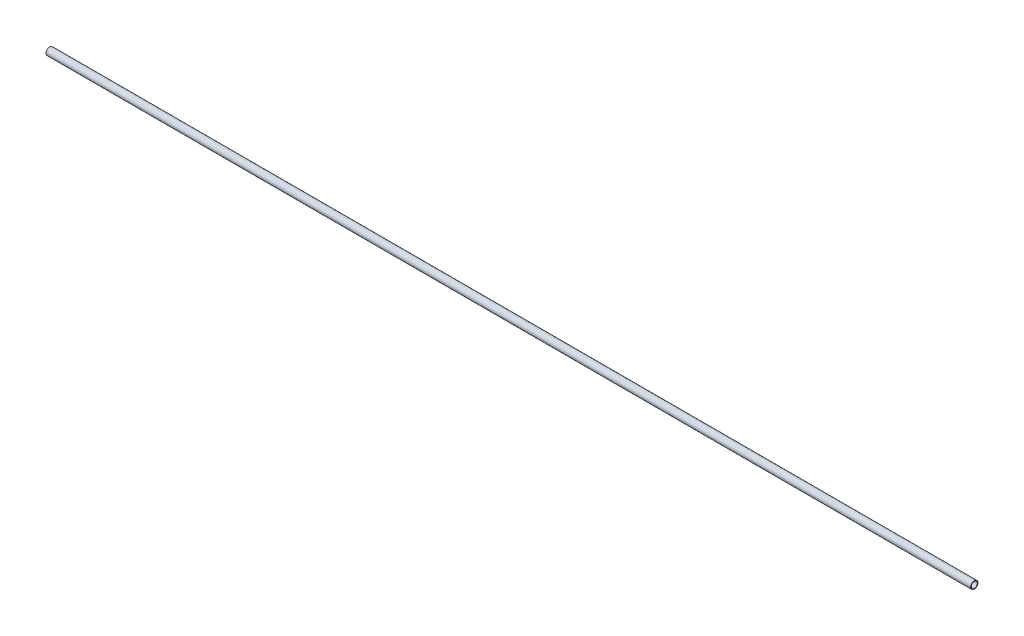
ISO-10303-21;
HEADER;
FILE_DESCRIPTION(('STEP AP214'),'2;1');
FILE_NAME('part.step','',(''),(''),'','','');
FILE_SCHEMA(('AUTOMOTIVE_DESIGN { 1 0 10303 214 1 1 1 1 }'));
ENDSEC;
DATA;
#1=APPLICATION_CONTEXT('core data for automotive mechanical design processes');
#2=APPLICATION_PROTOCOL_DEFINITION('international standard','automotive_design',2000,#1);
#3=PRODUCT_CONTEXT('',#1,'mechanical');
#4=PRODUCT('Part','Part','',(#3));
#5=PRODUCT_RELATED_PRODUCT_CATEGORY('part','',(#4));
#6=PRODUCT_DEFINITION_FORMATION('','',#4);
#7=PRODUCT_DEFINITION_CONTEXT('part definition',#1,'design');
#8=PRODUCT_DEFINITION('design','',#6,#7);
#9=PRODUCT_DEFINITION_SHAPE('','',#8);
#10=(LENGTH_UNIT() NAMED_UNIT(*) SI_UNIT(.MILLI.,.METRE.));
#11=(NAMED_UNIT(*) PLANE_ANGLE_UNIT() SI_UNIT($,.RADIAN.));
#12=(NAMED_UNIT(*) SI_UNIT($,.STERADIAN.) SOLID_ANGLE_UNIT());
#13=UNCERTAINTY_MEASURE_WITH_UNIT(LENGTH_MEASURE(1.E-05),#10,'distance_accuracy_value','');
#14=(GEOMETRIC_REPRESENTATION_CONTEXT(3) GLOBAL_UNCERTAINTY_ASSIGNED_CONTEXT((#13)) GLOBAL_UNIT_ASSIGNED_CONTEXT((#10,
#11,#12)) REPRESENTATION_CONTEXT('',''));
#15=CARTESIAN_POINT('',(0.,0.,0.));
#16=DIRECTION('',(0.,0.,1.));
#17=DIRECTION('',(1.,0.,0.));
#18=AXIS2_PLACEMENT_3D('',#15,#16,#17);
#19=CARTESIAN_POINT('',(0.,0.,0.));
#20=DIRECTION('',(1.,0.,0.));
#21=DIRECTION('',(0.,0.,-1.));
#22=AXIS2_PLACEMENT_3D('',#19,#20,#21);
#23=CYLINDRICAL_SURFACE('',#22,16.3);
#24=CARTESIAN_POINT('',(0.,0.,0.));
#25=DIRECTION('',(1.,0.,0.));
#26=DIRECTION('',(0.,0.,-1.));
#27=AXIS2_PLACEMENT_3D('',#24,#25,#26);
#28=CIRCLE('',#27,16.3);
#29=CARTESIAN_POINT('',(0.,0.,-16.3));
#30=VERTEX_POINT('',#29);
#31=EDGE_CURVE('E16',#30,#30,#28,.T.);
#32=ORIENTED_EDGE('',*,*,#31,.F.);
#33=EDGE_LOOP('',(#32));
#34=FACE_BOUND('',#33,.T.);
#35=CARTESIAN_POINT('',(5000.,0.,0.));
#36=DIRECTION('',(1.,0.,0.));
#37=DIRECTION('',(0.,0.,-1.));
#38=AXIS2_PLACEMENT_3D('',#35,#36,#37);
#39=CIRCLE('',#38,16.3);
#40=CARTESIAN_POINT('',(5000.,0.,-16.3));
#41=VERTEX_POINT('',#40);
#42=EDGE_CURVE('E25',#41,#41,#39,.F.);
#43=ORIENTED_EDGE('',*,*,#42,.F.);
#44=EDGE_LOOP('',(#43));
#45=FACE_BOUND('',#44,.T.);
#46=ADVANCED_FACE('F13',(#34,#45),#23,.F.);
#47=CARTESIAN_POINT('',(0.,-20.2400021082657,-20.));
#48=DIRECTION('',(-1.,0.,0.));
#49=DIRECTION('',(0.,0.,1.));
#50=AXIS2_PLACEMENT_3D('',#47,#48,#49);
#51=PLANE('',#50);
#52=ORIENTED_EDGE('',*,*,#31,.T.);
#53=EDGE_LOOP('',(#52));
#54=FACE_BOUND('',#53,.T.);
#55=CARTESIAN_POINT('',(0.,0.,0.));
#56=DIRECTION('',(1.,0.,0.));
#57=DIRECTION('',(0.,0.,-1.));
#58=AXIS2_PLACEMENT_3D('',#55,#56,#57);
#59=CIRCLE('',#58,20.);
#60=CARTESIAN_POINT('',(0.,0.,-20.));
#61=VERTEX_POINT('',#60);
#62=EDGE_CURVE('E20',#61,#61,#59,.T.);
#63=ORIENTED_EDGE('',*,*,#62,.F.);
#64=EDGE_LOOP('',(#63));
#65=FACE_BOUND('',#64,.T.);
#66=ADVANCED_FACE('F33',(#54,#65),#51,.T.);
#67=CARTESIAN_POINT('',(5000.,-20.2400021082657,20.));
#68=DIRECTION('',(1.,0.,0.));
#69=DIRECTION('',(0.,0.,-1.));
#70=AXIS2_PLACEMENT_3D('',#67,#68,#69);
#71=PLANE('',#70);
#72=ORIENTED_EDGE('',*,*,#42,.T.);
#73=EDGE_LOOP('',(#72));
#74=FACE_BOUND('',#73,.T.);
#75=CARTESIAN_POINT('',(5000.,0.,0.));
#76=DIRECTION('',(1.,0.,0.));
#77=DIRECTION('',(0.,0.,-1.));
#78=AXIS2_PLACEMENT_3D('',#75,#76,#77);
#79=CIRCLE('',#78,20.);
#80=CARTESIAN_POINT('',(5000.,0.,-20.));
#81=VERTEX_POINT('',#80);
#82=EDGE_CURVE('E8',#81,#81,#79,.F.);
#83=ORIENTED_EDGE('',*,*,#82,.F.);
#84=EDGE_LOOP('',(#83));
#85=FACE_BOUND('',#84,.T.);
#86=ADVANCED_FACE('F42',(#74,#85),#71,.T.);
#87=CARTESIAN_POINT('',(5000.,0.,0.));
#88=DIRECTION('',(1.,0.,0.));
#89=DIRECTION('',(0.,0.,-1.));
#90=AXIS2_PLACEMENT_3D('',#87,#88,#89);
#91=CYLINDRICAL_SURFACE('',#90,20.);
#92=ORIENTED_EDGE('',*,*,#62,.T.);
#93=EDGE_LOOP('',(#92));
#94=FACE_BOUND('',#93,.T.);
#95=ORIENTED_EDGE('',*,*,#82,.T.);
#96=EDGE_LOOP('',(#95));
#97=FACE_BOUND('',#96,.T.);
#98=ADVANCED_FACE('F43',(#94,#97),#91,.T.);
#99=CLOSED_SHELL('',(#46,#66,#86,#98));
#100=MANIFOLD_SOLID_BREP('B1',#99);
#101=ADVANCED_BREP_SHAPE_REPRESENTATION('',(#18,#100),#14);
#102=SHAPE_DEFINITION_REPRESENTATION(#9,#101);
ENDSEC;
END-ISO-10303-21;
